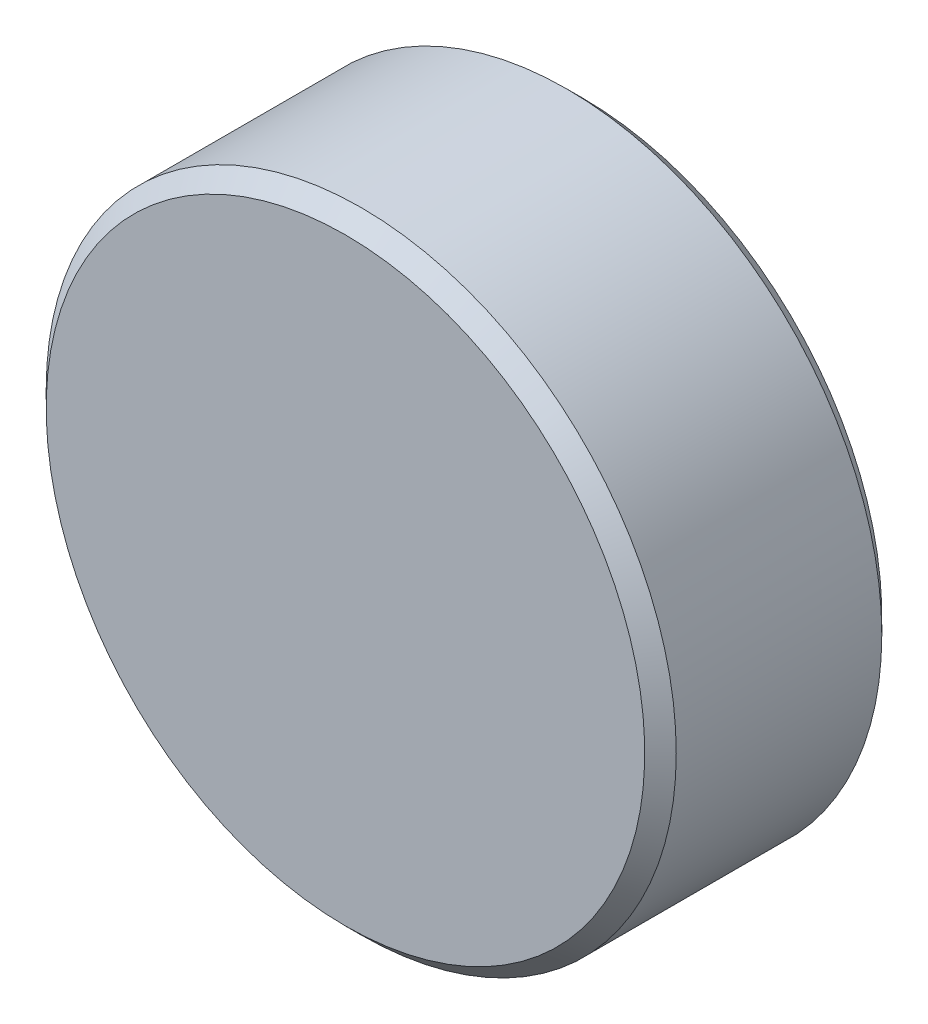
ISO-10303-21;
HEADER;
FILE_DESCRIPTION(('STEP AP214'),'2;1');
FILE_NAME('part.step','',(''),(''),'','','');
FILE_SCHEMA(('AUTOMOTIVE_DESIGN { 1 0 10303 214 1 1 1 1 }'));
ENDSEC;
DATA;
#1=APPLICATION_CONTEXT('core data for automotive mechanical design processes');
#2=APPLICATION_PROTOCOL_DEFINITION('international standard','automotive_design',2000,#1);
#3=PRODUCT_CONTEXT('',#1,'mechanical');
#4=PRODUCT('Part','Part','',(#3));
#5=PRODUCT_RELATED_PRODUCT_CATEGORY('part','',(#4));
#6=PRODUCT_DEFINITION_FORMATION('','',#4);
#7=PRODUCT_DEFINITION_CONTEXT('part definition',#1,'design');
#8=PRODUCT_DEFINITION('design','',#6,#7);
#9=PRODUCT_DEFINITION_SHAPE('','',#8);
#10=(LENGTH_UNIT() NAMED_UNIT(*) SI_UNIT(.MILLI.,.METRE.));
#11=(NAMED_UNIT(*) PLANE_ANGLE_UNIT() SI_UNIT($,.RADIAN.));
#12=(NAMED_UNIT(*) SI_UNIT($,.STERADIAN.) SOLID_ANGLE_UNIT());
#13=UNCERTAINTY_MEASURE_WITH_UNIT(LENGTH_MEASURE(1.E-05),#10,'distance_accuracy_value','');
#14=(GEOMETRIC_REPRESENTATION_CONTEXT(3) GLOBAL_UNCERTAINTY_ASSIGNED_CONTEXT((#13)) GLOBAL_UNIT_ASSIGNED_CONTEXT((#10,
#11,#12)) REPRESENTATION_CONTEXT('',''));
#15=CARTESIAN_POINT('',(0.,0.,0.));
#16=DIRECTION('',(0.,0.,1.));
#17=DIRECTION('',(1.,0.,0.));
#18=AXIS2_PLACEMENT_3D('',#15,#16,#17);
#19=CARTESIAN_POINT('',(0.,-11.75,495.175));
#20=DIRECTION('',(0.,0.,1.));
#21=DIRECTION('',(1.,0.,0.));
#22=AXIS2_PLACEMENT_3D('',#19,#20,#21);
#23=PLANE('',#22);
#24=CARTESIAN_POINT('',(0.,-11.75,495.175));
#25=DIRECTION('',(0.,0.,-1.));
#26=DIRECTION('',(0.,-1.,0.));
#27=AXIS2_PLACEMENT_3D('',#24,#25,#26);
#28=CIRCLE('',#27,38.);
#29=CARTESIAN_POINT('',(0.,-49.75,495.175));
#30=VERTEX_POINT('',#29);
#31=EDGE_CURVE('E21',#30,#30,#28,.T.);
#32=ORIENTED_EDGE('',*,*,#31,.T.);
#33=EDGE_LOOP('',(#32));
#34=FACE_BOUND('',#33,.T.);
#35=ADVANCED_FACE('F17',(#34),#23,.F.);
#36=CARTESIAN_POINT('',(0.,-11.75,525.275));
#37=DIRECTION('',(0.,0.,1.));
#38=DIRECTION('',(1.,0.,0.));
#39=AXIS2_PLACEMENT_3D('',#36,#37,#38);
#40=PLANE('',#39);
#41=CARTESIAN_POINT('',(0.,-11.75,525.275));
#42=DIRECTION('',(0.,0.,1.));
#43=DIRECTION('',(0.,-1.,0.));
#44=AXIS2_PLACEMENT_3D('',#41,#42,#43);
#45=CIRCLE('',#44,38.);
#46=CARTESIAN_POINT('',(0.,26.25,525.275));
#47=VERTEX_POINT('',#46);
#48=EDGE_CURVE('E28',#47,#47,#45,.T.);
#49=ORIENTED_EDGE('',*,*,#48,.T.);
#50=EDGE_LOOP('',(#49));
#51=FACE_BOUND('',#50,.T.);
#52=ADVANCED_FACE('F71',(#51),#40,.T.);
#53=CARTESIAN_POINT('',(0.,-11.75,525.275));
#54=DIRECTION('',(0.,0.,-1.));
#55=DIRECTION('',(0.,1.,0.));
#56=AXIS2_PLACEMENT_3D('',#53,#54,#55);
#57=CYLINDRICAL_SURFACE('',#56,40.);
#58=CARTESIAN_POINT('',(0.,-11.75,497.175));
#59=DIRECTION('',(0.,0.,1.));
#60=DIRECTION('',(0.,-1.,0.));
#61=AXIS2_PLACEMENT_3D('',#58,#59,#60);
#62=CIRCLE('',#61,40.);
#63=CARTESIAN_POINT('',(0.,-51.75,497.175));
#64=VERTEX_POINT('',#63);
#65=EDGE_CURVE('E48',#64,#64,#62,.T.);
#66=ORIENTED_EDGE('',*,*,#65,.T.);
#67=EDGE_LOOP('',(#66));
#68=FACE_BOUND('',#67,.T.);
#69=CARTESIAN_POINT('',(0.,-11.75,523.275));
#70=DIRECTION('',(0.,0.,-1.));
#71=DIRECTION('',(0.,-1.,0.));
#72=AXIS2_PLACEMENT_3D('',#69,#70,#71);
#73=CIRCLE('',#72,40.);
#74=CARTESIAN_POINT('',(0.,28.25,523.275));
#75=VERTEX_POINT('',#74);
#76=EDGE_CURVE('E11',#75,#75,#73,.T.);
#77=ORIENTED_EDGE('',*,*,#76,.T.);
#78=EDGE_LOOP('',(#77));
#79=FACE_BOUND('',#78,.T.);
#80=ADVANCED_FACE('F19',(#68,#79),#57,.T.);
#81=CARTESIAN_POINT('',(0.,-11.75,525.275));
#82=DIRECTION('',(0.,0.,-1.));
#83=DIRECTION('',(0.,1.,0.));
#84=AXIS2_PLACEMENT_3D('',#81,#82,#83);
#85=CONICAL_SURFACE('',#84,38.,0.785398163397448);
#86=ORIENTED_EDGE('',*,*,#76,.F.);
#87=EDGE_LOOP('',(#86));
#88=FACE_BOUND('',#87,.T.);
#89=ORIENTED_EDGE('',*,*,#48,.F.);
#90=EDGE_LOOP('',(#89));
#91=FACE_BOUND('',#90,.T.);
#92=ADVANCED_FACE('F73',(#88,#91),#85,.T.);
#93=CARTESIAN_POINT('',(0.,-11.75,497.175));
#94=DIRECTION('',(0.,0.,1.));
#95=DIRECTION('',(0.,-1.,0.));
#96=AXIS2_PLACEMENT_3D('',#93,#94,#95);
#97=CONICAL_SURFACE('',#96,40.,0.785398163397448);
#98=ORIENTED_EDGE('',*,*,#65,.F.);
#99=EDGE_LOOP('',(#98));
#100=FACE_BOUND('',#99,.T.);
#101=ORIENTED_EDGE('',*,*,#31,.F.);
#102=EDGE_LOOP('',(#101));
#103=FACE_BOUND('',#102,.T.);
#104=ADVANCED_FACE('F75',(#100,#103),#97,.T.);
#105=CLOSED_SHELL('',(#35,#52,#80,#92,#104));
#106=MANIFOLD_SOLID_BREP('B1',#105);
#107=ADVANCED_BREP_SHAPE_REPRESENTATION('',(#18,#106),#14);
#108=SHAPE_DEFINITION_REPRESENTATION(#9,#107);
ENDSEC;
END-ISO-10303-21;
